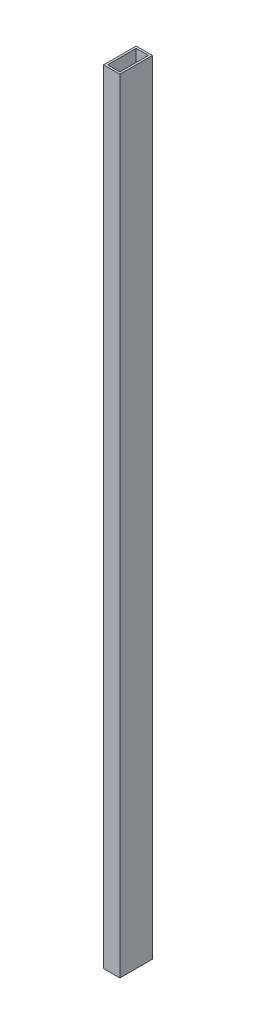
ISO-10303-21;
HEADER;
FILE_DESCRIPTION(('STEP AP214'),'2;1');
FILE_NAME('part.step','',(''),(''),'','','');
FILE_SCHEMA(('AUTOMOTIVE_DESIGN { 1 0 10303 214 1 1 1 1 }'));
ENDSEC;
DATA;
#1=APPLICATION_CONTEXT('core data for automotive mechanical design processes');
#2=APPLICATION_PROTOCOL_DEFINITION('international standard','automotive_design',2000,#1);
#3=PRODUCT_CONTEXT('',#1,'mechanical');
#4=PRODUCT('Part','Part','',(#3));
#5=PRODUCT_RELATED_PRODUCT_CATEGORY('part','',(#4));
#6=PRODUCT_DEFINITION_FORMATION('','',#4);
#7=PRODUCT_DEFINITION_CONTEXT('part definition',#1,'design');
#8=PRODUCT_DEFINITION('design','',#6,#7);
#9=PRODUCT_DEFINITION_SHAPE('','',#8);
#10=(LENGTH_UNIT() NAMED_UNIT(*) SI_UNIT(.MILLI.,.METRE.));
#11=(NAMED_UNIT(*) PLANE_ANGLE_UNIT() SI_UNIT($,.RADIAN.));
#12=(NAMED_UNIT(*) SI_UNIT($,.STERADIAN.) SOLID_ANGLE_UNIT());
#13=UNCERTAINTY_MEASURE_WITH_UNIT(LENGTH_MEASURE(1.E-05),#10,'distance_accuracy_value','');
#14=(GEOMETRIC_REPRESENTATION_CONTEXT(3) GLOBAL_UNCERTAINTY_ASSIGNED_CONTEXT((#13)) GLOBAL_UNIT_ASSIGNED_CONTEXT((#10,
#11,#12)) REPRESENTATION_CONTEXT('',''));
#15=CARTESIAN_POINT('',(0.,0.,0.));
#16=DIRECTION('',(0.,0.,1.));
#17=DIRECTION('',(1.,0.,0.));
#18=AXIS2_PLACEMENT_3D('',#15,#16,#17);
#19=CARTESIAN_POINT('',(0.,1219.2,0.));
#20=DIRECTION('',(0.,-1.,0.));
#21=DIRECTION('',(0.,0.,-1.));
#22=AXIS2_PLACEMENT_3D('',#19,#20,#21);
#23=PLANE('',#22);
#24=DIRECTION('',(0.,0.,1.));
#25=VECTOR('',#24,1.);
#26=CARTESIAN_POINT('',(0.,1219.2,0.));
#27=LINE('',#26,#25);
#28=CARTESIAN_POINT('',(0.,1219.2,-50.8));
#29=VERTEX_POINT('',#28);
#30=CARTESIAN_POINT('',(0.,1219.2,0.));
#31=VERTEX_POINT('',#30);
#32=EDGE_CURVE('E134',#29,#31,#27,.T.);
#33=ORIENTED_EDGE('',*,*,#32,.T.);
#34=DIRECTION('',(1.,0.,0.));
#35=VECTOR('',#34,1.);
#36=CARTESIAN_POINT('',(0.,1219.2,0.));
#37=LINE('',#36,#35);
#38=CARTESIAN_POINT('',(25.4,1219.2,0.));
#39=VERTEX_POINT('',#38);
#40=EDGE_CURVE('E137',#31,#39,#37,.T.);
#41=ORIENTED_EDGE('',*,*,#40,.T.);
#42=DIRECTION('',(0.,0.,-1.));
#43=VECTOR('',#42,1.);
#44=CARTESIAN_POINT('',(25.4,1219.2,0.));
#45=LINE('',#44,#43);
#46=CARTESIAN_POINT('',(25.4,1219.2,-50.8));
#47=VERTEX_POINT('',#46);
#48=EDGE_CURVE('E140',#39,#47,#45,.T.);
#49=ORIENTED_EDGE('',*,*,#48,.T.);
#50=DIRECTION('',(-1.,0.,0.));
#51=VECTOR('',#50,1.);
#52=CARTESIAN_POINT('',(0.,1219.2,-50.8));
#53=LINE('',#52,#51);
#54=EDGE_CURVE('E142',#47,#29,#53,.T.);
#55=ORIENTED_EDGE('',*,*,#54,.T.);
#56=EDGE_LOOP('',(#33,#41,#49,#55));
#57=FACE_BOUND('',#56,.T.);
#58=DIRECTION('',(0.,0.,1.));
#59=VECTOR('',#58,1.);
#60=CARTESIAN_POINT('',(3.175,1219.2,-47.625));
#61=LINE('',#60,#59);
#62=CARTESIAN_POINT('',(3.175,1219.2,-47.625));
#63=VERTEX_POINT('',#62);
#64=CARTESIAN_POINT('',(3.175,1219.2,-3.175));
#65=VERTEX_POINT('',#64);
#66=EDGE_CURVE('E98',#63,#65,#61,.T.);
#67=ORIENTED_EDGE('',*,*,#66,.F.);
#68=DIRECTION('',(-1.,0.,0.));
#69=VECTOR('',#68,1.);
#70=CARTESIAN_POINT('',(3.175,1219.2,-47.625));
#71=LINE('',#70,#69);
#72=CARTESIAN_POINT('',(22.225,1219.2,-47.625));
#73=VERTEX_POINT('',#72);
#74=EDGE_CURVE('E120',#73,#63,#71,.T.);
#75=ORIENTED_EDGE('',*,*,#74,.F.);
#76=DIRECTION('',(0.,0.,-1.));
#77=VECTOR('',#76,1.);
#78=CARTESIAN_POINT('',(22.225,1219.2,-47.625));
#79=LINE('',#78,#77);
#80=CARTESIAN_POINT('',(22.225,1219.2,-3.175));
#81=VERTEX_POINT('',#80);
#82=EDGE_CURVE('E118',#81,#73,#79,.T.);
#83=ORIENTED_EDGE('',*,*,#82,.F.);
#84=DIRECTION('',(1.,0.,0.));
#85=VECTOR('',#84,1.);
#86=CARTESIAN_POINT('',(3.175,1219.2,-3.175));
#87=LINE('',#86,#85);
#88=EDGE_CURVE('E106',#65,#81,#87,.T.);
#89=ORIENTED_EDGE('',*,*,#88,.F.);
#90=EDGE_LOOP('',(#67,#75,#83,#89));
#91=FACE_BOUND('',#90,.T.);
#92=ADVANCED_FACE('F33',(#57,#91),#23,.F.);
#93=CARTESIAN_POINT('',(0.,0.,0.));
#94=DIRECTION('',(0.,-1.,0.));
#95=DIRECTION('',(0.,0.,-1.));
#96=AXIS2_PLACEMENT_3D('',#93,#94,#95);
#97=PLANE('',#96);
#98=DIRECTION('',(0.,0.,1.));
#99=VECTOR('',#98,1.);
#100=CARTESIAN_POINT('',(0.,0.,0.));
#101=LINE('',#100,#99);
#102=CARTESIAN_POINT('',(0.,0.,-50.8));
#103=VERTEX_POINT('',#102);
#104=CARTESIAN_POINT('',(0.,0.,0.));
#105=VERTEX_POINT('',#104);
#106=EDGE_CURVE('E114',#103,#105,#101,.T.);
#107=ORIENTED_EDGE('',*,*,#106,.F.);
#108=DIRECTION('',(-1.,0.,0.));
#109=VECTOR('',#108,1.);
#110=CARTESIAN_POINT('',(0.,0.,-50.8));
#111=LINE('',#110,#109);
#112=CARTESIAN_POINT('',(25.4,0.,-50.8));
#113=VERTEX_POINT('',#112);
#114=EDGE_CURVE('E138',#113,#103,#111,.T.);
#115=ORIENTED_EDGE('',*,*,#114,.F.);
#116=DIRECTION('',(0.,0.,-1.));
#117=VECTOR('',#116,1.);
#118=CARTESIAN_POINT('',(25.4,0.,0.));
#119=LINE('',#118,#117);
#120=CARTESIAN_POINT('',(25.4,0.,0.));
#121=VERTEX_POINT('',#120);
#122=EDGE_CURVE('E149',#121,#113,#119,.T.);
#123=ORIENTED_EDGE('',*,*,#122,.F.);
#124=DIRECTION('',(1.,0.,0.));
#125=VECTOR('',#124,1.);
#126=CARTESIAN_POINT('',(0.,0.,0.));
#127=LINE('',#126,#125);
#128=EDGE_CURVE('E147',#105,#121,#127,.T.);
#129=ORIENTED_EDGE('',*,*,#128,.F.);
#130=EDGE_LOOP('',(#107,#115,#123,#129));
#131=FACE_BOUND('',#130,.T.);
#132=DIRECTION('',(-1.,0.,0.));
#133=VECTOR('',#132,1.);
#134=CARTESIAN_POINT('',(3.175,0.,-47.625));
#135=LINE('',#134,#133);
#136=CARTESIAN_POINT('',(22.225,0.,-47.625));
#137=VERTEX_POINT('',#136);
#138=CARTESIAN_POINT('',(3.175,0.,-47.625));
#139=VERTEX_POINT('',#138);
#140=EDGE_CURVE('E107',#137,#139,#135,.T.);
#141=ORIENTED_EDGE('',*,*,#140,.T.);
#142=DIRECTION('',(0.,0.,1.));
#143=VECTOR('',#142,1.);
#144=CARTESIAN_POINT('',(3.175,0.,-47.625));
#145=LINE('',#144,#143);
#146=CARTESIAN_POINT('',(3.175,0.,-3.175));
#147=VERTEX_POINT('',#146);
#148=EDGE_CURVE('E56',#139,#147,#145,.T.);
#149=ORIENTED_EDGE('',*,*,#148,.T.);
#150=DIRECTION('',(1.,0.,0.));
#151=VECTOR('',#150,1.);
#152=CARTESIAN_POINT('',(3.175,0.,-3.175));
#153=LINE('',#152,#151);
#154=CARTESIAN_POINT('',(22.225,0.,-3.175));
#155=VERTEX_POINT('',#154);
#156=EDGE_CURVE('E113',#147,#155,#153,.T.);
#157=ORIENTED_EDGE('',*,*,#156,.T.);
#158=DIRECTION('',(0.,0.,-1.));
#159=VECTOR('',#158,1.);
#160=CARTESIAN_POINT('',(22.225,0.,-47.625));
#161=LINE('',#160,#159);
#162=EDGE_CURVE('E126',#155,#137,#161,.T.);
#163=ORIENTED_EDGE('',*,*,#162,.T.);
#164=EDGE_LOOP('',(#141,#149,#157,#163));
#165=FACE_BOUND('',#164,.T.);
#166=ADVANCED_FACE('F167',(#131,#165),#97,.T.);
#167=CARTESIAN_POINT('',(0.,1219.2,0.));
#168=DIRECTION('',(1.,0.,0.));
#169=DIRECTION('',(0.,0.,-1.));
#170=AXIS2_PLACEMENT_3D('',#167,#168,#169);
#171=PLANE('',#170);
#172=ORIENTED_EDGE('',*,*,#106,.T.);
#173=DIRECTION('',(0.,-1.,0.));
#174=VECTOR('',#173,1.);
#175=CARTESIAN_POINT('',(0.,1219.2,0.));
#176=LINE('',#175,#174);
#177=EDGE_CURVE('E11',#31,#105,#176,.T.);
#178=ORIENTED_EDGE('',*,*,#177,.F.);
#179=ORIENTED_EDGE('',*,*,#32,.F.);
#180=DIRECTION('',(0.,-1.,0.));
#181=VECTOR('',#180,1.);
#182=CARTESIAN_POINT('',(0.,1219.2,-50.8));
#183=LINE('',#182,#181);
#184=EDGE_CURVE('E144',#29,#103,#183,.T.);
#185=ORIENTED_EDGE('',*,*,#184,.T.);
#186=EDGE_LOOP('',(#172,#178,#179,#185));
#187=FACE_BOUND('',#186,.T.);
#188=ADVANCED_FACE('F35',(#187),#171,.F.);
#189=CARTESIAN_POINT('',(0.,1219.2,0.));
#190=DIRECTION('',(0.,0.,-1.));
#191=DIRECTION('',(-1.,0.,0.));
#192=AXIS2_PLACEMENT_3D('',#189,#190,#191);
#193=PLANE('',#192);
#194=ORIENTED_EDGE('',*,*,#128,.T.);
#195=DIRECTION('',(0.,-1.,0.));
#196=VECTOR('',#195,1.);
#197=CARTESIAN_POINT('',(25.4,1219.2,0.));
#198=LINE('',#197,#196);
#199=EDGE_CURVE('E41',#39,#121,#198,.T.);
#200=ORIENTED_EDGE('',*,*,#199,.F.);
#201=ORIENTED_EDGE('',*,*,#40,.F.);
#202=ORIENTED_EDGE('',*,*,#177,.T.);
#203=EDGE_LOOP('',(#194,#200,#201,#202));
#204=FACE_BOUND('',#203,.T.);
#205=ADVANCED_FACE('F177',(#204),#193,.F.);
#206=CARTESIAN_POINT('',(25.4,1219.2,0.));
#207=DIRECTION('',(-1.,0.,0.));
#208=DIRECTION('',(0.,0.,1.));
#209=AXIS2_PLACEMENT_3D('',#206,#207,#208);
#210=PLANE('',#209);
#211=ORIENTED_EDGE('',*,*,#122,.T.);
#212=DIRECTION('',(0.,-1.,0.));
#213=VECTOR('',#212,1.);
#214=CARTESIAN_POINT('',(25.4,1219.2,-50.8));
#215=LINE('',#214,#213);
#216=EDGE_CURVE('E154',#47,#113,#215,.T.);
#217=ORIENTED_EDGE('',*,*,#216,.F.);
#218=ORIENTED_EDGE('',*,*,#48,.F.);
#219=ORIENTED_EDGE('',*,*,#199,.T.);
#220=EDGE_LOOP('',(#211,#217,#218,#219));
#221=FACE_BOUND('',#220,.T.);
#222=ADVANCED_FACE('F161',(#221),#210,.F.);
#223=CARTESIAN_POINT('',(0.,1219.2,-50.8));
#224=DIRECTION('',(0.,0.,1.));
#225=DIRECTION('',(1.,0.,0.));
#226=AXIS2_PLACEMENT_3D('',#223,#224,#225);
#227=PLANE('',#226);
#228=ORIENTED_EDGE('',*,*,#114,.T.);
#229=ORIENTED_EDGE('',*,*,#184,.F.);
#230=ORIENTED_EDGE('',*,*,#54,.F.);
#231=ORIENTED_EDGE('',*,*,#216,.T.);
#232=EDGE_LOOP('',(#228,#229,#230,#231));
#233=FACE_BOUND('',#232,.T.);
#234=ADVANCED_FACE('F171',(#233),#227,.F.);
#235=CARTESIAN_POINT('',(3.175,1219.2,-47.625));
#236=DIRECTION('',(1.,0.,0.));
#237=DIRECTION('',(0.,0.,-1.));
#238=AXIS2_PLACEMENT_3D('',#235,#236,#237);
#239=PLANE('',#238);
#240=ORIENTED_EDGE('',*,*,#148,.F.);
#241=DIRECTION('',(0.,-1.,0.));
#242=VECTOR('',#241,1.);
#243=CARTESIAN_POINT('',(3.175,1219.2,-47.625));
#244=LINE('',#243,#242);
#245=EDGE_CURVE('E102',#63,#139,#244,.T.);
#246=ORIENTED_EDGE('',*,*,#245,.F.);
#247=ORIENTED_EDGE('',*,*,#66,.T.);
#248=DIRECTION('',(0.,-1.,0.));
#249=VECTOR('',#248,1.);
#250=CARTESIAN_POINT('',(3.175,1219.2,-3.175));
#251=LINE('',#250,#249);
#252=EDGE_CURVE('E101',#65,#147,#251,.T.);
#253=ORIENTED_EDGE('',*,*,#252,.T.);
#254=EDGE_LOOP('',(#240,#246,#247,#253));
#255=FACE_BOUND('',#254,.T.);
#256=ADVANCED_FACE('F100',(#255),#239,.T.);
#257=CARTESIAN_POINT('',(3.175,1219.2,-3.175));
#258=DIRECTION('',(0.,0.,-1.));
#259=DIRECTION('',(-1.,0.,0.));
#260=AXIS2_PLACEMENT_3D('',#257,#258,#259);
#261=PLANE('',#260);
#262=ORIENTED_EDGE('',*,*,#156,.F.);
#263=ORIENTED_EDGE('',*,*,#252,.F.);
#264=ORIENTED_EDGE('',*,*,#88,.T.);
#265=DIRECTION('',(0.,-1.,0.));
#266=VECTOR('',#265,1.);
#267=CARTESIAN_POINT('',(22.225,1219.2,-3.175));
#268=LINE('',#267,#266);
#269=EDGE_CURVE('E115',#81,#155,#268,.T.);
#270=ORIENTED_EDGE('',*,*,#269,.T.);
#271=EDGE_LOOP('',(#262,#263,#264,#270));
#272=FACE_BOUND('',#271,.T.);
#273=ADVANCED_FACE('F110',(#272),#261,.T.);
#274=CARTESIAN_POINT('',(22.225,1219.2,-47.625));
#275=DIRECTION('',(-1.,0.,0.));
#276=DIRECTION('',(0.,0.,1.));
#277=AXIS2_PLACEMENT_3D('',#274,#275,#276);
#278=PLANE('',#277);
#279=ORIENTED_EDGE('',*,*,#162,.F.);
#280=ORIENTED_EDGE('',*,*,#269,.F.);
#281=ORIENTED_EDGE('',*,*,#82,.T.);
#282=DIRECTION('',(0.,-1.,0.));
#283=VECTOR('',#282,1.);
#284=CARTESIAN_POINT('',(22.225,1219.2,-47.625));
#285=LINE('',#284,#283);
#286=EDGE_CURVE('E48',#73,#137,#285,.T.);
#287=ORIENTED_EDGE('',*,*,#286,.T.);
#288=EDGE_LOOP('',(#279,#280,#281,#287));
#289=FACE_BOUND('',#288,.T.);
#290=ADVANCED_FACE('F200',(#289),#278,.T.);
#291=CARTESIAN_POINT('',(3.175,1219.2,-47.625));
#292=DIRECTION('',(0.,0.,1.));
#293=DIRECTION('',(1.,0.,0.));
#294=AXIS2_PLACEMENT_3D('',#291,#292,#293);
#295=PLANE('',#294);
#296=ORIENTED_EDGE('',*,*,#140,.F.);
#297=ORIENTED_EDGE('',*,*,#286,.F.);
#298=ORIENTED_EDGE('',*,*,#74,.T.);
#299=ORIENTED_EDGE('',*,*,#245,.T.);
#300=EDGE_LOOP('',(#296,#297,#298,#299));
#301=FACE_BOUND('',#300,.T.);
#302=ADVANCED_FACE('F204',(#301),#295,.T.);
#303=CLOSED_SHELL('',(#92,#166,#188,#205,#222,#234,#256,#273,#290,#302));
#304=MANIFOLD_SOLID_BREP('B2',#303);
#305=ADVANCED_BREP_SHAPE_REPRESENTATION('',(#18,#304),#14);
#306=SHAPE_DEFINITION_REPRESENTATION(#9,#305);
ENDSEC;
END-ISO-10303-21;
